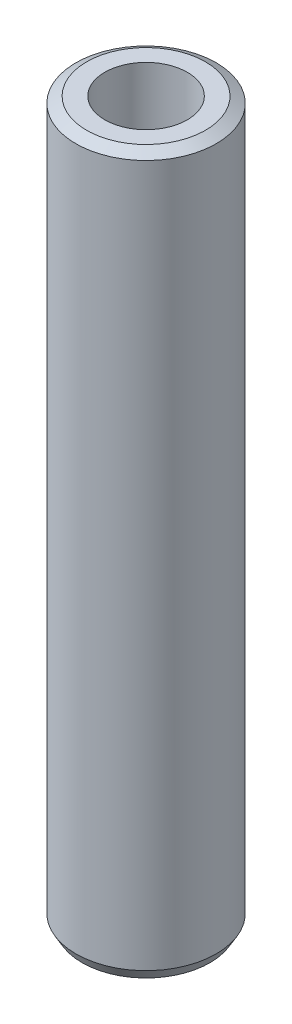
ISO-10303-21;
HEADER;
FILE_DESCRIPTION(('STEP AP214'),'2;1');
FILE_NAME('part.step','',(''),(''),'','','');
FILE_SCHEMA(('AUTOMOTIVE_DESIGN { 1 0 10303 214 1 1 1 1 }'));
ENDSEC;
DATA;
#1=APPLICATION_CONTEXT('core data for automotive mechanical design processes');
#2=APPLICATION_PROTOCOL_DEFINITION('international standard','automotive_design',2000,#1);
#3=PRODUCT_CONTEXT('',#1,'mechanical');
#4=PRODUCT('Part','Part','',(#3));
#5=PRODUCT_RELATED_PRODUCT_CATEGORY('part','',(#4));
#6=PRODUCT_DEFINITION_FORMATION('','',#4);
#7=PRODUCT_DEFINITION_CONTEXT('part definition',#1,'design');
#8=PRODUCT_DEFINITION('design','',#6,#7);
#9=PRODUCT_DEFINITION_SHAPE('','',#8);
#10=(LENGTH_UNIT() NAMED_UNIT(*) SI_UNIT(.MILLI.,.METRE.));
#11=(NAMED_UNIT(*) PLANE_ANGLE_UNIT() SI_UNIT($,.RADIAN.));
#12=(NAMED_UNIT(*) SI_UNIT($,.STERADIAN.) SOLID_ANGLE_UNIT());
#13=UNCERTAINTY_MEASURE_WITH_UNIT(LENGTH_MEASURE(1.E-05),#10,'distance_accuracy_value','');
#14=(GEOMETRIC_REPRESENTATION_CONTEXT(3) GLOBAL_UNCERTAINTY_ASSIGNED_CONTEXT((#13)) GLOBAL_UNIT_ASSIGNED_CONTEXT((#10,
#11,#12)) REPRESENTATION_CONTEXT('',''));
#15=CARTESIAN_POINT('',(0.,0.,0.));
#16=DIRECTION('',(0.,0.,1.));
#17=DIRECTION('',(1.,0.,0.));
#18=AXIS2_PLACEMENT_3D('',#15,#16,#17);
#19=CARTESIAN_POINT('',(0.,409.588902547704,0.));
#20=DIRECTION('',(0.,-1.,0.));
#21=DIRECTION('',(0.,0.,-1.));
#22=AXIS2_PLACEMENT_3D('',#19,#20,#21);
#23=CYLINDRICAL_SURFACE('',#22,40.);
#24=CARTESIAN_POINT('',(0.,406.036900341307,0.));
#25=DIRECTION('',(0.,1.,0.));
#26=DIRECTION('',(0.,0.,1.));
#27=AXIS2_PLACEMENT_3D('',#24,#25,#26);
#28=CIRCLE('',#27,40.);
#29=CARTESIAN_POINT('',(0.,406.036900341307,-40.));
#30=VERTEX_POINT('',#29);
#31=EDGE_CURVE('E50',#30,#30,#28,.F.);
#32=ORIENTED_EDGE('',*,*,#31,.T.);
#33=EDGE_LOOP('',(#32));
#34=FACE_BOUND('',#33,.T.);
#35=CARTESIAN_POINT('',(0.,6.15224829007543,0.));
#36=DIRECTION('',(0.,1.,0.));
#37=DIRECTION('',(0.,0.,1.));
#38=AXIS2_PLACEMENT_3D('',#35,#36,#37);
#39=CIRCLE('',#38,40.);
#40=CARTESIAN_POINT('',(0.,6.15224829007543,40.));
#41=VERTEX_POINT('',#40);
#42=EDGE_CURVE('E51',#41,#41,#39,.T.);
#43=ORIENTED_EDGE('',*,*,#42,.T.);
#44=EDGE_LOOP('',(#43));
#45=FACE_BOUND('',#44,.T.);
#46=ADVANCED_FACE('F39',(#34,#45),#23,.T.);
#47=CARTESIAN_POINT('',(0.,409.588902547704,0.));
#48=DIRECTION('',(0.,1.,0.));
#49=DIRECTION('',(0.,0.,1.));
#50=AXIS2_PLACEMENT_3D('',#47,#48,#49);
#51=PLANE('',#50);
#52=CARTESIAN_POINT('',(0.,409.588902547704,0.));
#53=DIRECTION('',(0.,1.,0.));
#54=DIRECTION('',(0.,0.,1.));
#55=AXIS2_PLACEMENT_3D('',#52,#53,#54);
#56=CIRCLE('',#55,33.8477517099245);
#57=CARTESIAN_POINT('',(0.,409.588902547703,-33.8477517099246));
#58=VERTEX_POINT('',#57);
#59=EDGE_CURVE('E54',#58,#58,#56,.T.);
#60=ORIENTED_EDGE('',*,*,#59,.T.);
#61=EDGE_LOOP('',(#60));
#62=FACE_BOUND('',#61,.T.);
#63=CARTESIAN_POINT('',(0.,409.588902547704,0.));
#64=DIRECTION('',(0.,1.,0.));
#65=DIRECTION('',(0.,0.,1.));
#66=AXIS2_PLACEMENT_3D('',#63,#64,#65);
#67=CIRCLE('',#66,23.5126327205172);
#68=CARTESIAN_POINT('',(0.,409.588902547704,23.5126327205172));
#69=VERTEX_POINT('',#68);
#70=EDGE_CURVE('E58',#69,#69,#67,.T.);
#71=ORIENTED_EDGE('',*,*,#70,.F.);
#72=EDGE_LOOP('',(#71));
#73=FACE_BOUND('',#72,.T.);
#74=ADVANCED_FACE('F69',(#62,#73),#51,.T.);
#75=CARTESIAN_POINT('',(0.,0.,0.));
#76=DIRECTION('',(0.,1.,0.));
#77=DIRECTION('',(0.,0.,1.));
#78=AXIS2_PLACEMENT_3D('',#75,#76,#77);
#79=PLANE('',#78);
#80=CARTESIAN_POINT('',(0.,0.,0.));
#81=DIRECTION('',(0.,1.,0.));
#82=DIRECTION('',(0.,0.,1.));
#83=AXIS2_PLACEMENT_3D('',#80,#81,#82);
#84=CIRCLE('',#83,36.4479977936036);
#85=CARTESIAN_POINT('',(0.,0.,36.4479977936036));
#86=VERTEX_POINT('',#85);
#87=EDGE_CURVE('E10',#86,#86,#84,.F.);
#88=ORIENTED_EDGE('',*,*,#87,.T.);
#89=EDGE_LOOP('',(#88));
#90=FACE_BOUND('',#89,.T.);
#91=CARTESIAN_POINT('',(0.,0.,0.));
#92=DIRECTION('',(0.,1.,0.));
#93=DIRECTION('',(0.,0.,1.));
#94=AXIS2_PLACEMENT_3D('',#91,#92,#93);
#95=CIRCLE('',#94,23.5126327205172);
#96=CARTESIAN_POINT('',(0.,0.,23.5126327205172));
#97=VERTEX_POINT('',#96);
#98=EDGE_CURVE('E63',#97,#97,#95,.T.);
#99=ORIENTED_EDGE('',*,*,#98,.T.);
#100=EDGE_LOOP('',(#99));
#101=FACE_BOUND('',#100,.T.);
#102=ADVANCED_FACE('F75',(#90,#101),#79,.F.);
#103=CARTESIAN_POINT('',(0.,409.588902547704,0.));
#104=DIRECTION('',(0.,-1.,0.));
#105=DIRECTION('',(0.,0.,-1.));
#106=AXIS2_PLACEMENT_3D('',#103,#104,#105);
#107=CYLINDRICAL_SURFACE('',#106,23.5126327205172);
#108=ORIENTED_EDGE('',*,*,#70,.T.);
#109=EDGE_LOOP('',(#108));
#110=FACE_BOUND('',#109,.T.);
#111=ORIENTED_EDGE('',*,*,#98,.F.);
#112=EDGE_LOOP('',(#111));
#113=FACE_BOUND('',#112,.T.);
#114=ADVANCED_FACE('F70',(#110,#113),#107,.F.);
#115=CARTESIAN_POINT('',(0.,409.588902547704,0.));
#116=DIRECTION('',(0.,-1.,0.));
#117=DIRECTION('',(0.,0.,-1.));
#118=AXIS2_PLACEMENT_3D('',#115,#116,#117);
#119=CONICAL_SURFACE('',#118,33.8477517099245,1.04719755119659);
#120=CARTESIAN_POINT('',(0.,406.036900341307,-40.));
#121=CARTESIAN_POINT('',(0.,406.07390036429,-39.9359140803118));
#122=CARTESIAN_POINT('',(0.,406.110900387274,-39.8718281606235));
#123=CARTESIAN_POINT('',(0.,406.18490043324,-39.7436563212469));
#124=CARTESIAN_POINT('',(0.,406.221900456223,-39.6795704015586));
#125=CARTESIAN_POINT('',(0.,406.29590050219,-39.551398562182));
#126=CARTESIAN_POINT('',(0.,406.332900525173,-39.4873126424938));
#127=CARTESIAN_POINT('',(0.,406.40690057114,-39.3591408031172));
#128=CARTESIAN_POINT('',(0.,406.443900594123,-39.2950548834289));
#129=CARTESIAN_POINT('',(0.,406.51790064009,-39.1668830440523));
#130=CARTESIAN_POINT('',(0.,406.554900663073,-39.102797124364));
#131=CARTESIAN_POINT('',(0.,406.62890070904,-38.9746252849875));
#132=CARTESIAN_POINT('',(0.,406.665900732023,-38.9105393652992));
#133=CARTESIAN_POINT('',(0.,406.73990077799,-38.7823675259226));
#134=CARTESIAN_POINT('',(0.,406.776900800973,-38.7182816062343));
#135=CARTESIAN_POINT('',(0.,406.85090084694,-38.5901097668578));
#136=CARTESIAN_POINT('',(0.,406.887900869923,-38.5260238471695));
#137=CARTESIAN_POINT('',(0.,406.961900915889,-38.3978520077929));
#138=CARTESIAN_POINT('',(0.,406.998900938873,-38.3337660881046));
#139=CARTESIAN_POINT('',(0.,407.072900984839,-38.205594248728));
#140=CARTESIAN_POINT('',(0.,407.109901007823,-38.1415083290398));
#141=CARTESIAN_POINT('',(0.,407.183901053789,-38.0133364896632));
#142=CARTESIAN_POINT('',(0.,407.220901076773,-37.9492505699749));
#143=CARTESIAN_POINT('',(0.,407.294901122739,-37.8210787305983));
#144=CARTESIAN_POINT('',(0.,407.331901145722,-37.75699281091));
#145=CARTESIAN_POINT('',(0.,407.405901191689,-37.6288209715335));
#146=CARTESIAN_POINT('',(0.,407.442901214672,-37.5647350518452));
#147=CARTESIAN_POINT('',(0.,407.516901260639,-37.4365632124686));
#148=CARTESIAN_POINT('',(0.,407.553901283622,-37.3724772927803));
#149=CARTESIAN_POINT('',(0.,407.627901329589,-37.2443054534037));
#150=CARTESIAN_POINT('',(0.,407.664901352572,-37.1802195337155));
#151=CARTESIAN_POINT('',(0.,407.738901398539,-37.0520476943389));
#152=CARTESIAN_POINT('',(0.,407.775901421522,-36.9879617746506));
#153=CARTESIAN_POINT('',(0.,407.849901467489,-36.859789935274));
#154=CARTESIAN_POINT('',(0.,407.886901490472,-36.7957040155858));
#155=CARTESIAN_POINT('',(0.,407.960901536438,-36.6675321762092));
#156=CARTESIAN_POINT('',(0.,407.997901559422,-36.6034462565209));
#157=CARTESIAN_POINT('',(0.,408.071901605388,-36.4752744171443));
#158=CARTESIAN_POINT('',(0.,408.108901628372,-36.411188497456));
#159=CARTESIAN_POINT('',(0.,408.182901674338,-36.2830166580795));
#160=CARTESIAN_POINT('',(0.,408.219901697322,-36.2189307383912));
#161=CARTESIAN_POINT('',(0.,408.293901743288,-36.0907588990146));
#162=CARTESIAN_POINT('',(0.,408.330901766271,-36.0266729793263));
#163=CARTESIAN_POINT('',(0.,408.404901812238,-35.8985011399497));
#164=CARTESIAN_POINT('',(0.,408.441901835221,-35.8344152202615));
#165=CARTESIAN_POINT('',(0.,408.515901881188,-35.7062433808849));
#166=CARTESIAN_POINT('',(0.,408.552901904171,-35.6421574611966));
#167=CARTESIAN_POINT('',(0.,408.626901950138,-35.51398562182));
#168=CARTESIAN_POINT('',(0.,408.663901973121,-35.4498997021317));
#169=CARTESIAN_POINT('',(0.,408.737902019088,-35.3217278627552));
#170=CARTESIAN_POINT('',(0.,408.774902042071,-35.2576419430669));
#171=CARTESIAN_POINT('',(0.,408.848902088038,-35.1294701036903));
#172=CARTESIAN_POINT('',(0.,408.885902111021,-35.065384184002));
#173=CARTESIAN_POINT('',(0.,408.959902156987,-34.9372123446255));
#174=CARTESIAN_POINT('',(0.,408.996902179971,-34.8731264249372));
#175=CARTESIAN_POINT('',(0.,409.070902225937,-34.7449545855606));
#176=CARTESIAN_POINT('',(0.,409.107902248921,-34.6808686658723));
#177=CARTESIAN_POINT('',(0.,409.181902294887,-34.5526968264957));
#178=CARTESIAN_POINT('',(0.,409.218902317871,-34.4886109068075));
#179=CARTESIAN_POINT('',(0.,409.292902363837,-34.3604390674309));
#180=CARTESIAN_POINT('',(0.,409.32990238682,-34.2963531477426));
#181=CARTESIAN_POINT('',(0.,409.403902432787,-34.168181308366));
#182=CARTESIAN_POINT('',(0.,409.44090245577,-34.1040953886777));
#183=CARTESIAN_POINT('',(0.,409.514902501737,-33.9759235493012));
#184=CARTESIAN_POINT('',(0.,409.55190252472,-33.9118376296129));
#185=CARTESIAN_POINT('',(0.,409.588902547704,-33.8477517099246));
#186=B_SPLINE_CURVE_WITH_KNOTS('',3,(#120,#121,#122,#123,#124,#125,#126,#127,#128,#129,#130,
#131,#132,#133,#134,#135,#136,#137,#138,#139,#140,#141,#142,#143,#144,#145,#146,#147,#148,#149,
#150,#151,#152,#153,#154,#155,#156,#157,#158,#159,#160,#161,#162,#163,#164,#165,#166,#167,#168,
#169,#170,#171,#172,#173,#174,#175,#176,#177,#178,#179,#180,#181,#182,#183,#184,#185),
.UNSPECIFIED.,.F.,.F.,(4,2,2,2,2,2,2,2,2,2,2,2,2,2,2,2,2,2,2,2,2,2,2,2,2,2,2,2,2,2,2,2,4),(0.,
0.222000137899796,0.44400027579957,0.666000413699344,0.88800055159914,1.11000068949891,
1.33200082739868,1.55400096529848,1.77600110319826,1.99800124109803,2.22000137899783,
2.4420015168976,2.66400165479737,2.88600179269717,3.10800193059694,3.33000206849671,
3.55200220639648,3.77400234429628,3.99600248219606,4.21800262009583,4.44000275799563,
4.6620028958954,4.88400303379517,5.10600317169497,5.32800330959474,5.55000344749451,
5.77200358539432,5.99400372329408,6.21600386119386,6.43800399909365,6.66000413699343,
6.8820042748932,7.104004412793),.UNSPECIFIED.);
#187=EDGE_CURVE('BSEAM81',#30,#58,#186,.T.);
#188=ORIENTED_EDGE('',*,*,#31,.F.);
#189=ORIENTED_EDGE('',*,*,#59,.F.);
#190=ORIENTED_EDGE('',*,*,#187,.T.);
#191=ORIENTED_EDGE('',*,*,#187,.F.);
#192=EDGE_LOOP('',(#188,#190,#189,#191));
#193=FACE_BOUND('',#192,.T.);
#194=ADVANCED_FACE('F81',(#193),#119,.T.);
#195=CARTESIAN_POINT('',(0.,6.15224829007543,0.));
#196=DIRECTION('',(0.,1.,0.));
#197=DIRECTION('',(0.,0.,1.));
#198=AXIS2_PLACEMENT_3D('',#195,#196,#197);
#199=CONICAL_SURFACE('',#198,40.,0.523598775598296);
#200=ORIENTED_EDGE('',*,*,#87,.F.);
#201=EDGE_LOOP('',(#200));
#202=FACE_BOUND('',#201,.T.);
#203=ORIENTED_EDGE('',*,*,#42,.F.);
#204=EDGE_LOOP('',(#203));
#205=FACE_BOUND('',#204,.T.);
#206=ADVANCED_FACE('F45',(#202,#205),#199,.T.);
#207=CLOSED_SHELL('',(#46,#74,#102,#114,#194,#206));
#208=MANIFOLD_SOLID_BREP('B2',#207);
#209=ADVANCED_BREP_SHAPE_REPRESENTATION('',(#18,#208),#14);
#210=SHAPE_DEFINITION_REPRESENTATION(#9,#209);
ENDSEC;
END-ISO-10303-21;
